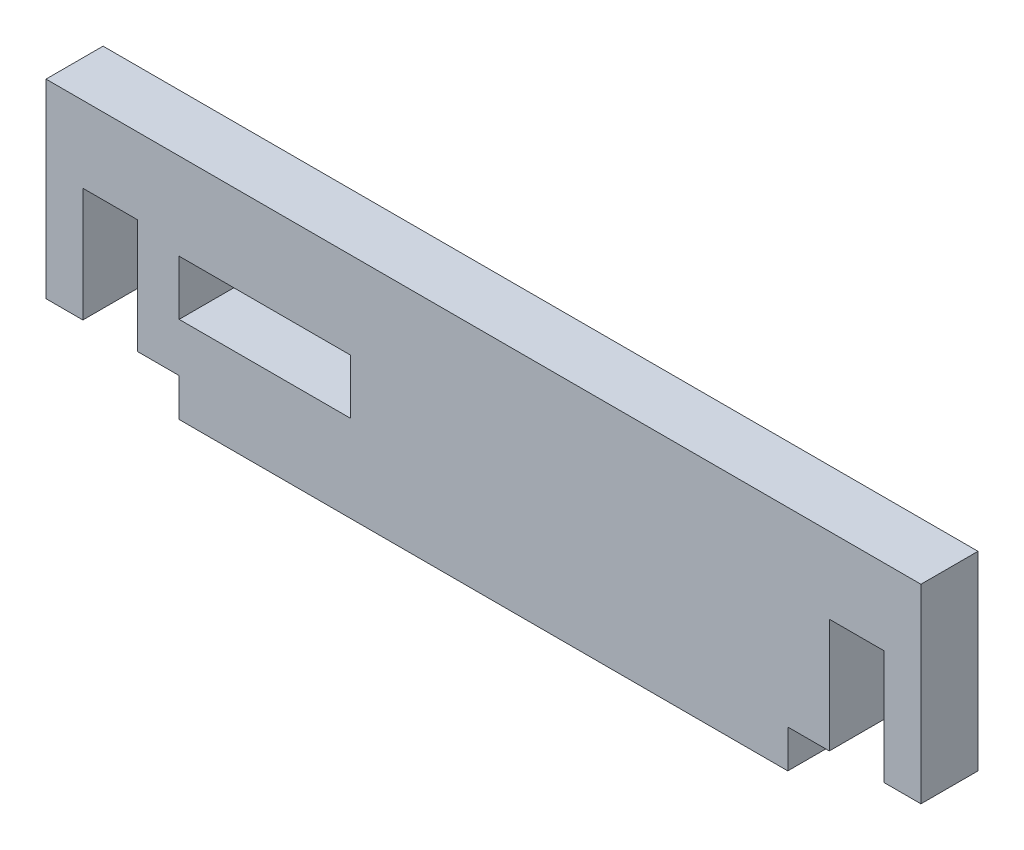
ISO-10303-21;
HEADER;
FILE_DESCRIPTION(('STEP AP214'),'2;1');
FILE_NAME('part.step','',(''),(''),'','','');
FILE_SCHEMA(('AUTOMOTIVE_DESIGN { 1 0 10303 214 1 1 1 1 }'));
ENDSEC;
DATA;
#1=APPLICATION_CONTEXT('core data for automotive mechanical design processes');
#2=APPLICATION_PROTOCOL_DEFINITION('international standard','automotive_design',2000,#1);
#3=PRODUCT_CONTEXT('',#1,'mechanical');
#4=PRODUCT('Part','Part','',(#3));
#5=PRODUCT_RELATED_PRODUCT_CATEGORY('part','',(#4));
#6=PRODUCT_DEFINITION_FORMATION('','',#4);
#7=PRODUCT_DEFINITION_CONTEXT('part definition',#1,'design');
#8=PRODUCT_DEFINITION('design','',#6,#7);
#9=PRODUCT_DEFINITION_SHAPE('','',#8);
#10=(LENGTH_UNIT() NAMED_UNIT(*) SI_UNIT(.MILLI.,.METRE.));
#11=(NAMED_UNIT(*) PLANE_ANGLE_UNIT() SI_UNIT($,.RADIAN.));
#12=(NAMED_UNIT(*) SI_UNIT($,.STERADIAN.) SOLID_ANGLE_UNIT());
#13=UNCERTAINTY_MEASURE_WITH_UNIT(LENGTH_MEASURE(1.E-05),#10,'distance_accuracy_value','');
#14=(GEOMETRIC_REPRESENTATION_CONTEXT(3) GLOBAL_UNCERTAINTY_ASSIGNED_CONTEXT((#13)) GLOBAL_UNIT_ASSIGNED_CONTEXT((#10,
#11,#12)) REPRESENTATION_CONTEXT('',''));
#15=CARTESIAN_POINT('',(0.,0.,0.));
#16=DIRECTION('',(0.,0.,1.));
#17=DIRECTION('',(1.,0.,0.));
#18=AXIS2_PLACEMENT_3D('',#15,#16,#17);
#19=CARTESIAN_POINT('',(0.,4.56,3.));
#20=DIRECTION('',(0.,1.,0.));
#21=DIRECTION('',(-1.,0.,0.));
#22=AXIS2_PLACEMENT_3D('',#19,#20,#21);
#23=PLANE('',#22);
#24=DIRECTION('',(1.,0.,0.));
#25=VECTOR('',#24,1.);
#26=CARTESIAN_POINT('',(0.,4.56,0.));
#27=LINE('',#26,#25);
#28=CARTESIAN_POINT('',(0.,4.56,0.));
#29=VERTEX_POINT('',#28);
#30=CARTESIAN_POINT('',(9.,4.56,0.));
#31=VERTEX_POINT('',#30);
#32=EDGE_CURVE('E260',#29,#31,#27,.T.);
#33=ORIENTED_EDGE('',*,*,#32,.F.);
#34=DIRECTION('',(0.,0.,-1.));
#35=VECTOR('',#34,1.);
#36=CARTESIAN_POINT('',(0.,4.56,3.));
#37=LINE('',#36,#35);
#38=CARTESIAN_POINT('',(0.,4.56,3.));
#39=VERTEX_POINT('',#38);
#40=EDGE_CURVE('E12',#39,#29,#37,.T.);
#41=ORIENTED_EDGE('',*,*,#40,.F.);
#42=DIRECTION('',(1.,0.,0.));
#43=VECTOR('',#42,1.);
#44=CARTESIAN_POINT('',(0.,4.56,3.));
#45=LINE('',#44,#43);
#46=CARTESIAN_POINT('',(9.,4.56,3.));
#47=VERTEX_POINT('',#46);
#48=EDGE_CURVE('E201',#39,#47,#45,.T.);
#49=ORIENTED_EDGE('',*,*,#48,.T.);
#50=DIRECTION('',(0.,0.,-1.));
#51=VECTOR('',#50,1.);
#52=CARTESIAN_POINT('',(9.,4.56,3.));
#53=LINE('',#52,#51);
#54=EDGE_CURVE('E130',#47,#31,#53,.T.);
#55=ORIENTED_EDGE('',*,*,#54,.T.);
#56=EDGE_LOOP('',(#33,#41,#49,#55));
#57=FACE_BOUND('',#56,.T.);
#58=ADVANCED_FACE('F41',(#57),#23,.T.);
#59=CARTESIAN_POINT('',(0.,0.,3.));
#60=DIRECTION('',(-1.,0.,0.));
#61=DIRECTION('',(0.,0.,1.));
#62=AXIS2_PLACEMENT_3D('',#59,#60,#61);
#63=PLANE('',#62);
#64=DIRECTION('',(0.,1.,0.));
#65=VECTOR('',#64,1.);
#66=CARTESIAN_POINT('',(0.,0.,0.));
#67=LINE('',#66,#65);
#68=CARTESIAN_POINT('',(0.,7.437,0.));
#69=VERTEX_POINT('',#68);
#70=EDGE_CURVE('E207',#29,#69,#67,.T.);
#71=ORIENTED_EDGE('',*,*,#70,.T.);
#72=DIRECTION('',(0.,0.,-1.));
#73=VECTOR('',#72,1.);
#74=CARTESIAN_POINT('',(0.,7.437,3.));
#75=LINE('',#74,#73);
#76=CARTESIAN_POINT('',(0.,7.437,3.));
#77=VERTEX_POINT('',#76);
#78=EDGE_CURVE('E51',#77,#69,#75,.T.);
#79=ORIENTED_EDGE('',*,*,#78,.F.);
#80=DIRECTION('',(0.,1.,0.));
#81=VECTOR('',#80,1.);
#82=CARTESIAN_POINT('',(0.,0.,3.));
#83=LINE('',#82,#81);
#84=EDGE_CURVE('E197',#39,#77,#83,.T.);
#85=ORIENTED_EDGE('',*,*,#84,.F.);
#86=ORIENTED_EDGE('',*,*,#40,.T.);
#87=EDGE_LOOP('',(#71,#79,#85,#86));
#88=FACE_BOUND('',#87,.T.);
#89=ADVANCED_FACE('F205',(#88),#63,.F.);
#90=CARTESIAN_POINT('',(0.,7.437,3.));
#91=DIRECTION('',(0.,1.,0.));
#92=DIRECTION('',(0.,0.,1.));
#93=AXIS2_PLACEMENT_3D('',#90,#91,#92);
#94=PLANE('',#93);
#95=DIRECTION('',(1.,0.,0.));
#96=VECTOR('',#95,1.);
#97=CARTESIAN_POINT('',(0.,7.437,0.));
#98=LINE('',#97,#96);
#99=CARTESIAN_POINT('',(9.,7.437,0.));
#100=VERTEX_POINT('',#99);
#101=EDGE_CURVE('E257',#69,#100,#98,.T.);
#102=ORIENTED_EDGE('',*,*,#101,.T.);
#103=DIRECTION('',(0.,0.,-1.));
#104=VECTOR('',#103,1.);
#105=CARTESIAN_POINT('',(9.,7.437,3.));
#106=LINE('',#105,#104);
#107=CARTESIAN_POINT('',(9.,7.437,3.));
#108=VERTEX_POINT('',#107);
#109=EDGE_CURVE('E195',#108,#100,#106,.T.);
#110=ORIENTED_EDGE('',*,*,#109,.F.);
#111=DIRECTION('',(1.,0.,0.));
#112=VECTOR('',#111,1.);
#113=CARTESIAN_POINT('',(0.,7.437,3.));
#114=LINE('',#113,#112);
#115=EDGE_CURVE('E189',#77,#108,#114,.T.);
#116=ORIENTED_EDGE('',*,*,#115,.F.);
#117=ORIENTED_EDGE('',*,*,#78,.T.);
#118=EDGE_LOOP('',(#102,#110,#116,#117));
#119=FACE_BOUND('',#118,.T.);
#120=ADVANCED_FACE('F192',(#119),#94,.F.);
#121=CARTESIAN_POINT('',(39.,0.,3.));
#122=DIRECTION('',(1.,0.,0.));
#123=DIRECTION('',(0.,0.,-1.));
#124=AXIS2_PLACEMENT_3D('',#121,#122,#123);
#125=PLANE('',#124);
#126=DIRECTION('',(0.,-1.,0.));
#127=VECTOR('',#126,1.);
#128=CARTESIAN_POINT('',(39.,0.,0.));
#129=LINE('',#128,#127);
#130=CARTESIAN_POINT('',(39.,12.,0.));
#131=VERTEX_POINT('',#130);
#132=CARTESIAN_POINT('',(39.,2.,0.));
#133=VERTEX_POINT('',#132);
#134=EDGE_CURVE('E295',#131,#133,#129,.T.);
#135=ORIENTED_EDGE('',*,*,#134,.F.);
#136=DIRECTION('',(0.,0.,-1.));
#137=VECTOR('',#136,1.);
#138=CARTESIAN_POINT('',(39.,12.,3.));
#139=LINE('',#138,#137);
#140=CARTESIAN_POINT('',(39.,12.,3.));
#141=VERTEX_POINT('',#140);
#142=EDGE_CURVE('E45',#141,#131,#139,.T.);
#143=ORIENTED_EDGE('',*,*,#142,.F.);
#144=DIRECTION('',(0.,-1.,0.));
#145=VECTOR('',#144,1.);
#146=CARTESIAN_POINT('',(39.,0.,3.));
#147=LINE('',#146,#145);
#148=CARTESIAN_POINT('',(39.,2.,3.));
#149=VERTEX_POINT('',#148);
#150=EDGE_CURVE('E256',#141,#149,#147,.T.);
#151=ORIENTED_EDGE('',*,*,#150,.T.);
#152=DIRECTION('',(0.,0.,-1.));
#153=VECTOR('',#152,1.);
#154=CARTESIAN_POINT('',(39.,2.,3.));
#155=LINE('',#154,#153);
#156=EDGE_CURVE('E212',#149,#133,#155,.T.);
#157=ORIENTED_EDGE('',*,*,#156,.T.);
#158=EDGE_LOOP('',(#135,#143,#151,#157));
#159=FACE_BOUND('',#158,.T.);
#160=ADVANCED_FACE('F43',(#159),#125,.T.);
#161=CARTESIAN_POINT('',(0.,12.,3.));
#162=DIRECTION('',(0.,-1.,0.));
#163=DIRECTION('',(0.,0.,-1.));
#164=AXIS2_PLACEMENT_3D('',#161,#162,#163);
#165=PLANE('',#164);
#166=DIRECTION('',(-1.,0.,0.));
#167=VECTOR('',#166,1.);
#168=CARTESIAN_POINT('',(0.,12.,0.));
#169=LINE('',#168,#167);
#170=CARTESIAN_POINT('',(-7.,12.,0.));
#171=VERTEX_POINT('',#170);
#172=EDGE_CURVE('E293',#131,#171,#169,.T.);
#173=ORIENTED_EDGE('',*,*,#172,.T.);
#174=DIRECTION('',(0.,0.,-1.));
#175=VECTOR('',#174,1.);
#176=CARTESIAN_POINT('',(-7.,12.,3.));
#177=LINE('',#176,#175);
#178=CARTESIAN_POINT('',(-7.,12.,3.));
#179=VERTEX_POINT('',#178);
#180=EDGE_CURVE('E245',#179,#171,#177,.T.);
#181=ORIENTED_EDGE('',*,*,#180,.F.);
#182=DIRECTION('',(-1.,0.,0.));
#183=VECTOR('',#182,1.);
#184=CARTESIAN_POINT('',(0.,12.,3.));
#185=LINE('',#184,#183);
#186=EDGE_CURVE('E374',#141,#179,#185,.T.);
#187=ORIENTED_EDGE('',*,*,#186,.F.);
#188=ORIENTED_EDGE('',*,*,#142,.T.);
#189=EDGE_LOOP('',(#173,#181,#187,#188));
#190=FACE_BOUND('',#189,.T.);
#191=ADVANCED_FACE('F386',(#190),#165,.F.);
#192=CARTESIAN_POINT('',(-7.,0.,3.));
#193=DIRECTION('',(1.,0.,0.));
#194=DIRECTION('',(0.,0.,-1.));
#195=AXIS2_PLACEMENT_3D('',#192,#193,#194);
#196=PLANE('',#195);
#197=DIRECTION('',(0.,-1.,0.));
#198=VECTOR('',#197,1.);
#199=CARTESIAN_POINT('',(-7.,0.,0.));
#200=LINE('',#199,#198);
#201=CARTESIAN_POINT('',(-7.,2.,0.));
#202=VERTEX_POINT('',#201);
#203=EDGE_CURVE('E291',#171,#202,#200,.T.);
#204=ORIENTED_EDGE('',*,*,#203,.T.);
#205=DIRECTION('',(0.,0.,-1.));
#206=VECTOR('',#205,1.);
#207=CARTESIAN_POINT('',(-7.,2.,3.));
#208=LINE('',#207,#206);
#209=CARTESIAN_POINT('',(-7.,2.,3.));
#210=VERTEX_POINT('',#209);
#211=EDGE_CURVE('E244',#210,#202,#208,.T.);
#212=ORIENTED_EDGE('',*,*,#211,.F.);
#213=DIRECTION('',(0.,-1.,0.));
#214=VECTOR('',#213,1.);
#215=CARTESIAN_POINT('',(-7.,0.,3.));
#216=LINE('',#215,#214);
#217=EDGE_CURVE('E369',#179,#210,#216,.T.);
#218=ORIENTED_EDGE('',*,*,#217,.F.);
#219=ORIENTED_EDGE('',*,*,#180,.T.);
#220=EDGE_LOOP('',(#204,#212,#218,#219));
#221=FACE_BOUND('',#220,.T.);
#222=ADVANCED_FACE('F387',(#221),#196,.F.);
#223=CARTESIAN_POINT('',(0.,2.,3.));
#224=DIRECTION('',(0.,-1.,0.));
#225=DIRECTION('',(0.,0.,-1.));
#226=AXIS2_PLACEMENT_3D('',#223,#224,#225);
#227=PLANE('',#226);
#228=DIRECTION('',(-1.,0.,0.));
#229=VECTOR('',#228,1.);
#230=CARTESIAN_POINT('',(0.,2.,0.));
#231=LINE('',#230,#229);
#232=CARTESIAN_POINT('',(-5.0615,2.,0.));
#233=VERTEX_POINT('',#232);
#234=EDGE_CURVE('E288',#233,#202,#231,.T.);
#235=ORIENTED_EDGE('',*,*,#234,.F.);
#236=DIRECTION('',(0.,0.,-1.));
#237=VECTOR('',#236,1.);
#238=CARTESIAN_POINT('',(-5.0615,2.,3.));
#239=LINE('',#238,#237);
#240=CARTESIAN_POINT('',(-5.0615,2.,3.));
#241=VERTEX_POINT('',#240);
#242=EDGE_CURVE('E242',#241,#233,#239,.T.);
#243=ORIENTED_EDGE('',*,*,#242,.F.);
#244=DIRECTION('',(-1.,0.,0.));
#245=VECTOR('',#244,1.);
#246=CARTESIAN_POINT('',(0.,2.,3.));
#247=LINE('',#246,#245);
#248=EDGE_CURVE('E364',#241,#210,#247,.T.);
#249=ORIENTED_EDGE('',*,*,#248,.T.);
#250=ORIENTED_EDGE('',*,*,#211,.T.);
#251=EDGE_LOOP('',(#235,#243,#249,#250));
#252=FACE_BOUND('',#251,.T.);
#253=ADVANCED_FACE('F390',(#252),#227,.T.);
#254=CARTESIAN_POINT('',(-5.0615,0.,3.));
#255=DIRECTION('',(1.,0.,0.));
#256=DIRECTION('',(0.,0.,-1.));
#257=AXIS2_PLACEMENT_3D('',#254,#255,#256);
#258=PLANE('',#257);
#259=DIRECTION('',(0.,-1.,0.));
#260=VECTOR('',#259,1.);
#261=CARTESIAN_POINT('',(-5.0615,0.,0.));
#262=LINE('',#261,#260);
#263=CARTESIAN_POINT('',(-5.0615,8.,0.));
#264=VERTEX_POINT('',#263);
#265=EDGE_CURVE('E285',#264,#233,#262,.T.);
#266=ORIENTED_EDGE('',*,*,#265,.F.);
#267=DIRECTION('',(0.,0.,-1.));
#268=VECTOR('',#267,1.);
#269=CARTESIAN_POINT('',(-5.0615,8.,3.));
#270=LINE('',#269,#268);
#271=CARTESIAN_POINT('',(-5.0615,8.,3.));
#272=VERTEX_POINT('',#271);
#273=EDGE_CURVE('E240',#272,#264,#270,.T.);
#274=ORIENTED_EDGE('',*,*,#273,.F.);
#275=DIRECTION('',(0.,-1.,0.));
#276=VECTOR('',#275,1.);
#277=CARTESIAN_POINT('',(-5.0615,0.,3.));
#278=LINE('',#277,#276);
#279=EDGE_CURVE('E360',#272,#241,#278,.T.);
#280=ORIENTED_EDGE('',*,*,#279,.T.);
#281=ORIENTED_EDGE('',*,*,#242,.T.);
#282=EDGE_LOOP('',(#266,#274,#280,#281));
#283=FACE_BOUND('',#282,.T.);
#284=ADVANCED_FACE('F396',(#283),#258,.T.);
#285=CARTESIAN_POINT('',(0.,7.99999999999995,3.));
#286=DIRECTION('',(0.,-1.,0.));
#287=DIRECTION('',(1.,0.,0.));
#288=AXIS2_PLACEMENT_3D('',#285,#286,#287);
#289=PLANE('',#288);
#290=DIRECTION('',(-1.,0.,0.));
#291=VECTOR('',#290,1.);
#292=CARTESIAN_POINT('',(0.,7.99999999999995,0.));
#293=LINE('',#292,#291);
#294=CARTESIAN_POINT('',(-2.1845,7.99999999999997,0.));
#295=VERTEX_POINT('',#294);
#296=EDGE_CURVE('E282',#295,#264,#293,.T.);
#297=ORIENTED_EDGE('',*,*,#296,.F.);
#298=DIRECTION('',(0.,0.,-1.));
#299=VECTOR('',#298,1.);
#300=CARTESIAN_POINT('',(-2.1845,7.99999999999997,3.));
#301=LINE('',#300,#299);
#302=CARTESIAN_POINT('',(-2.1845,7.99999999999997,3.));
#303=VERTEX_POINT('',#302);
#304=EDGE_CURVE('E238',#303,#295,#301,.T.);
#305=ORIENTED_EDGE('',*,*,#304,.F.);
#306=DIRECTION('',(-1.,0.,0.));
#307=VECTOR('',#306,1.);
#308=CARTESIAN_POINT('',(0.,7.99999999999995,3.));
#309=LINE('',#308,#307);
#310=EDGE_CURVE('E353',#303,#272,#309,.T.);
#311=ORIENTED_EDGE('',*,*,#310,.T.);
#312=ORIENTED_EDGE('',*,*,#273,.T.);
#313=EDGE_LOOP('',(#297,#305,#311,#312));
#314=FACE_BOUND('',#313,.T.);
#315=ADVANCED_FACE('F399',(#314),#289,.T.);
#316=CARTESIAN_POINT('',(-2.1845,0.,3.));
#317=DIRECTION('',(-1.,0.,0.));
#318=DIRECTION('',(0.,0.,1.));
#319=AXIS2_PLACEMENT_3D('',#316,#317,#318);
#320=PLANE('',#319);
#321=DIRECTION('',(0.,1.,0.));
#322=VECTOR('',#321,1.);
#323=CARTESIAN_POINT('',(-2.1845,0.,0.));
#324=LINE('',#323,#322);
#325=CARTESIAN_POINT('',(-2.1845,2.,0.));
#326=VERTEX_POINT('',#325);
#327=EDGE_CURVE('E279',#326,#295,#324,.T.);
#328=ORIENTED_EDGE('',*,*,#327,.F.);
#329=DIRECTION('',(0.,0.,-1.));
#330=VECTOR('',#329,1.);
#331=CARTESIAN_POINT('',(-2.1845,2.,3.));
#332=LINE('',#331,#330);
#333=CARTESIAN_POINT('',(-2.1845,2.,3.));
#334=VERTEX_POINT('',#333);
#335=EDGE_CURVE('E236',#334,#326,#332,.T.);
#336=ORIENTED_EDGE('',*,*,#335,.F.);
#337=DIRECTION('',(0.,1.,0.));
#338=VECTOR('',#337,1.);
#339=CARTESIAN_POINT('',(-2.1845,0.,3.));
#340=LINE('',#339,#338);
#341=EDGE_CURVE('E348',#334,#303,#340,.T.);
#342=ORIENTED_EDGE('',*,*,#341,.T.);
#343=ORIENTED_EDGE('',*,*,#304,.T.);
#344=EDGE_LOOP('',(#328,#336,#342,#343));
#345=FACE_BOUND('',#344,.T.);
#346=ADVANCED_FACE('F422',(#345),#320,.T.);
#347=CARTESIAN_POINT('',(0.,2.,0.));
#348=VERTEX_POINT('',#347);
#349=EDGE_CURVE('E278',#348,#326,#231,.T.);
#350=ORIENTED_EDGE('',*,*,#349,.F.);
#351=DIRECTION('',(0.,0.,-1.));
#352=VECTOR('',#351,1.);
#353=CARTESIAN_POINT('',(0.,2.,3.));
#354=LINE('',#353,#352);
#355=CARTESIAN_POINT('',(0.,2.,3.));
#356=VERTEX_POINT('',#355);
#357=EDGE_CURVE('E234',#356,#348,#354,.T.);
#358=ORIENTED_EDGE('',*,*,#357,.F.);
#359=EDGE_CURVE('E347',#356,#334,#247,.T.);
#360=ORIENTED_EDGE('',*,*,#359,.T.);
#361=ORIENTED_EDGE('',*,*,#335,.T.);
#362=EDGE_LOOP('',(#350,#358,#360,#361));
#363=FACE_BOUND('',#362,.T.);
#364=ADVANCED_FACE('F426',(#363),#227,.T.);
#365=CARTESIAN_POINT('',(0.,0.,3.));
#366=DIRECTION('',(-1.,0.,0.));
#367=DIRECTION('',(0.,0.,1.));
#368=AXIS2_PLACEMENT_3D('',#365,#366,#367);
#369=PLANE('',#368);
#370=DIRECTION('',(0.,1.,0.));
#371=VECTOR('',#370,1.);
#372=CARTESIAN_POINT('',(0.,0.,0.));
#373=LINE('',#372,#371);
#374=CARTESIAN_POINT('',(0.,0.,0.));
#375=VERTEX_POINT('',#374);
#376=EDGE_CURVE('E275',#375,#348,#373,.T.);
#377=ORIENTED_EDGE('',*,*,#376,.F.);
#378=DIRECTION('',(0.,0.,-1.));
#379=VECTOR('',#378,1.);
#380=CARTESIAN_POINT('',(0.,0.,3.));
#381=LINE('',#380,#379);
#382=CARTESIAN_POINT('',(0.,0.,3.));
#383=VERTEX_POINT('',#382);
#384=EDGE_CURVE('E232',#383,#375,#381,.T.);
#385=ORIENTED_EDGE('',*,*,#384,.F.);
#386=DIRECTION('',(0.,1.,0.));
#387=VECTOR('',#386,1.);
#388=CARTESIAN_POINT('',(0.,0.,3.));
#389=LINE('',#388,#387);
#390=EDGE_CURVE('E342',#383,#356,#389,.T.);
#391=ORIENTED_EDGE('',*,*,#390,.T.);
#392=ORIENTED_EDGE('',*,*,#357,.T.);
#393=EDGE_LOOP('',(#377,#385,#391,#392));
#394=FACE_BOUND('',#393,.T.);
#395=ADVANCED_FACE('F429',(#394),#369,.T.);
#396=CARTESIAN_POINT('',(0.,0.,3.));
#397=DIRECTION('',(0.,1.,0.));
#398=DIRECTION('',(0.,0.,1.));
#399=AXIS2_PLACEMENT_3D('',#396,#397,#398);
#400=PLANE('',#399);
#401=DIRECTION('',(1.,0.,0.));
#402=VECTOR('',#401,1.);
#403=CARTESIAN_POINT('',(0.,0.,0.));
#404=LINE('',#403,#402);
#405=CARTESIAN_POINT('',(32.,0.,0.));
#406=VERTEX_POINT('',#405);
#407=EDGE_CURVE('E273',#375,#406,#404,.T.);
#408=ORIENTED_EDGE('',*,*,#407,.T.);
#409=DIRECTION('',(0.,0.,-1.));
#410=VECTOR('',#409,1.);
#411=CARTESIAN_POINT('',(32.,0.,3.));
#412=LINE('',#411,#410);
#413=CARTESIAN_POINT('',(32.,0.,3.));
#414=VERTEX_POINT('',#413);
#415=EDGE_CURVE('E229',#414,#406,#412,.T.);
#416=ORIENTED_EDGE('',*,*,#415,.F.);
#417=DIRECTION('',(1.,0.,0.));
#418=VECTOR('',#417,1.);
#419=CARTESIAN_POINT('',(0.,0.,3.));
#420=LINE('',#419,#418);
#421=EDGE_CURVE('E334',#383,#414,#420,.T.);
#422=ORIENTED_EDGE('',*,*,#421,.F.);
#423=ORIENTED_EDGE('',*,*,#384,.T.);
#424=EDGE_LOOP('',(#408,#416,#422,#423));
#425=FACE_BOUND('',#424,.T.);
#426=ADVANCED_FACE('F435',(#425),#400,.F.);
#427=CARTESIAN_POINT('',(32.,0.,3.));
#428=DIRECTION('',(-1.,0.,0.));
#429=DIRECTION('',(0.,0.,1.));
#430=AXIS2_PLACEMENT_3D('',#427,#428,#429);
#431=PLANE('',#430);
#432=DIRECTION('',(0.,1.,0.));
#433=VECTOR('',#432,1.);
#434=CARTESIAN_POINT('',(32.,0.,0.));
#435=LINE('',#434,#433);
#436=CARTESIAN_POINT('',(32.,2.,0.));
#437=VERTEX_POINT('',#436);
#438=EDGE_CURVE('E271',#406,#437,#435,.T.);
#439=ORIENTED_EDGE('',*,*,#438,.T.);
#440=DIRECTION('',(0.,0.,-1.));
#441=VECTOR('',#440,1.);
#442=CARTESIAN_POINT('',(32.,2.,3.));
#443=LINE('',#442,#441);
#444=CARTESIAN_POINT('',(32.,2.,3.));
#445=VERTEX_POINT('',#444);
#446=EDGE_CURVE('E226',#445,#437,#443,.T.);
#447=ORIENTED_EDGE('',*,*,#446,.F.);
#448=DIRECTION('',(0.,1.,0.));
#449=VECTOR('',#448,1.);
#450=CARTESIAN_POINT('',(32.,0.,3.));
#451=LINE('',#450,#449);
#452=EDGE_CURVE('E329',#414,#445,#451,.T.);
#453=ORIENTED_EDGE('',*,*,#452,.F.);
#454=ORIENTED_EDGE('',*,*,#415,.T.);
#455=EDGE_LOOP('',(#439,#447,#453,#454));
#456=FACE_BOUND('',#455,.T.);
#457=ADVANCED_FACE('F439',(#456),#431,.F.);
#458=CARTESIAN_POINT('',(0.,2.,3.));
#459=DIRECTION('',(0.,1.,0.));
#460=DIRECTION('',(0.,0.,1.));
#461=AXIS2_PLACEMENT_3D('',#458,#459,#460);
#462=PLANE('',#461);
#463=DIRECTION('',(1.,0.,0.));
#464=VECTOR('',#463,1.);
#465=CARTESIAN_POINT('',(0.,2.,0.));
#466=LINE('',#465,#464);
#467=CARTESIAN_POINT('',(34.1845,2.,0.));
#468=VERTEX_POINT('',#467);
#469=EDGE_CURVE('E269',#437,#468,#466,.T.);
#470=ORIENTED_EDGE('',*,*,#469,.T.);
#471=DIRECTION('',(0.,0.,-1.));
#472=VECTOR('',#471,1.);
#473=CARTESIAN_POINT('',(34.1845,2.,3.));
#474=LINE('',#473,#472);
#475=CARTESIAN_POINT('',(34.1845,2.,3.));
#476=VERTEX_POINT('',#475);
#477=EDGE_CURVE('E223',#476,#468,#474,.T.);
#478=ORIENTED_EDGE('',*,*,#477,.F.);
#479=DIRECTION('',(1.,0.,0.));
#480=VECTOR('',#479,1.);
#481=CARTESIAN_POINT('',(0.,2.,3.));
#482=LINE('',#481,#480);
#483=EDGE_CURVE('E325',#445,#476,#482,.T.);
#484=ORIENTED_EDGE('',*,*,#483,.F.);
#485=ORIENTED_EDGE('',*,*,#446,.T.);
#486=EDGE_LOOP('',(#470,#478,#484,#485));
#487=FACE_BOUND('',#486,.T.);
#488=ADVANCED_FACE('F444',(#487),#462,.F.);
#489=CARTESIAN_POINT('',(34.1845,0.,3.));
#490=DIRECTION('',(-1.,0.,0.));
#491=DIRECTION('',(0.,0.,1.));
#492=AXIS2_PLACEMENT_3D('',#489,#490,#491);
#493=PLANE('',#492);
#494=DIRECTION('',(0.,1.,0.));
#495=VECTOR('',#494,1.);
#496=CARTESIAN_POINT('',(34.1845,0.,0.));
#497=LINE('',#496,#495);
#498=CARTESIAN_POINT('',(34.1845,7.99999999999997,0.));
#499=VERTEX_POINT('',#498);
#500=EDGE_CURVE('E267',#468,#499,#497,.T.);
#501=ORIENTED_EDGE('',*,*,#500,.T.);
#502=DIRECTION('',(0.,0.,-1.));
#503=VECTOR('',#502,1.);
#504=CARTESIAN_POINT('',(34.1845,7.99999999999997,3.));
#505=LINE('',#504,#503);
#506=CARTESIAN_POINT('',(34.1845,7.99999999999997,3.));
#507=VERTEX_POINT('',#506);
#508=EDGE_CURVE('E220',#507,#499,#505,.T.);
#509=ORIENTED_EDGE('',*,*,#508,.F.);
#510=DIRECTION('',(0.,1.,0.));
#511=VECTOR('',#510,1.);
#512=CARTESIAN_POINT('',(34.1845,0.,3.));
#513=LINE('',#512,#511);
#514=EDGE_CURVE('E322',#476,#507,#513,.T.);
#515=ORIENTED_EDGE('',*,*,#514,.F.);
#516=ORIENTED_EDGE('',*,*,#477,.T.);
#517=EDGE_LOOP('',(#501,#509,#515,#516));
#518=FACE_BOUND('',#517,.T.);
#519=ADVANCED_FACE('F450',(#518),#493,.F.);
#520=CARTESIAN_POINT('',(0.,7.99999999999962,3.));
#521=DIRECTION('',(0.,1.,0.));
#522=DIRECTION('',(-1.,0.,0.));
#523=AXIS2_PLACEMENT_3D('',#520,#521,#522);
#524=PLANE('',#523);
#525=DIRECTION('',(1.,0.,0.));
#526=VECTOR('',#525,1.);
#527=CARTESIAN_POINT('',(0.,7.99999999999962,0.));
#528=LINE('',#527,#526);
#529=CARTESIAN_POINT('',(37.0615,8.,0.));
#530=VERTEX_POINT('',#529);
#531=EDGE_CURVE('E265',#499,#530,#528,.T.);
#532=ORIENTED_EDGE('',*,*,#531,.T.);
#533=DIRECTION('',(0.,0.,-1.));
#534=VECTOR('',#533,1.);
#535=CARTESIAN_POINT('',(37.0615,8.,3.));
#536=LINE('',#535,#534);
#537=CARTESIAN_POINT('',(37.0615,8.,3.));
#538=VERTEX_POINT('',#537);
#539=EDGE_CURVE('E217',#538,#530,#536,.T.);
#540=ORIENTED_EDGE('',*,*,#539,.F.);
#541=DIRECTION('',(1.,0.,0.));
#542=VECTOR('',#541,1.);
#543=CARTESIAN_POINT('',(0.,7.99999999999962,3.));
#544=LINE('',#543,#542);
#545=EDGE_CURVE('E315',#507,#538,#544,.T.);
#546=ORIENTED_EDGE('',*,*,#545,.F.);
#547=ORIENTED_EDGE('',*,*,#508,.T.);
#548=EDGE_LOOP('',(#532,#540,#546,#547));
#549=FACE_BOUND('',#548,.T.);
#550=ADVANCED_FACE('F454',(#549),#524,.F.);
#551=CARTESIAN_POINT('',(37.0615,0.,3.));
#552=DIRECTION('',(1.,0.,0.));
#553=DIRECTION('',(0.,0.,-1.));
#554=AXIS2_PLACEMENT_3D('',#551,#552,#553);
#555=PLANE('',#554);
#556=DIRECTION('',(0.,-1.,0.));
#557=VECTOR('',#556,1.);
#558=CARTESIAN_POINT('',(37.0615,0.,0.));
#559=LINE('',#558,#557);
#560=CARTESIAN_POINT('',(37.0615,2.,0.));
#561=VERTEX_POINT('',#560);
#562=EDGE_CURVE('E263',#530,#561,#559,.T.);
#563=ORIENTED_EDGE('',*,*,#562,.T.);
#564=DIRECTION('',(0.,0.,-1.));
#565=VECTOR('',#564,1.);
#566=CARTESIAN_POINT('',(37.0615,2.,3.));
#567=LINE('',#566,#565);
#568=CARTESIAN_POINT('',(37.0615,2.,3.));
#569=VERTEX_POINT('',#568);
#570=EDGE_CURVE('E214',#569,#561,#567,.T.);
#571=ORIENTED_EDGE('',*,*,#570,.F.);
#572=DIRECTION('',(0.,-1.,0.));
#573=VECTOR('',#572,1.);
#574=CARTESIAN_POINT('',(37.0615,0.,3.));
#575=LINE('',#574,#573);
#576=EDGE_CURVE('E311',#538,#569,#575,.T.);
#577=ORIENTED_EDGE('',*,*,#576,.F.);
#578=ORIENTED_EDGE('',*,*,#539,.T.);
#579=EDGE_LOOP('',(#563,#571,#577,#578));
#580=FACE_BOUND('',#579,.T.);
#581=ADVANCED_FACE('F456',(#580),#555,.F.);
#582=EDGE_CURVE('E262',#561,#133,#466,.T.);
#583=ORIENTED_EDGE('',*,*,#582,.T.);
#584=ORIENTED_EDGE('',*,*,#156,.F.);
#585=EDGE_CURVE('E310',#569,#149,#482,.T.);
#586=ORIENTED_EDGE('',*,*,#585,.F.);
#587=ORIENTED_EDGE('',*,*,#570,.T.);
#588=EDGE_LOOP('',(#583,#584,#586,#587));
#589=FACE_BOUND('',#588,.T.);
#590=ADVANCED_FACE('F413',(#589),#462,.F.);
#591=CARTESIAN_POINT('',(9.,0.,3.));
#592=DIRECTION('',(1.,0.,0.));
#593=DIRECTION('',(0.,0.,-1.));
#594=AXIS2_PLACEMENT_3D('',#591,#592,#593);
#595=PLANE('',#594);
#596=DIRECTION('',(0.,-1.,0.));
#597=VECTOR('',#596,1.);
#598=CARTESIAN_POINT('',(9.,0.,0.));
#599=LINE('',#598,#597);
#600=EDGE_CURVE('E123',#100,#31,#599,.T.);
#601=ORIENTED_EDGE('',*,*,#600,.T.);
#602=ORIENTED_EDGE('',*,*,#54,.F.);
#603=DIRECTION('',(0.,-1.,0.));
#604=VECTOR('',#603,1.);
#605=CARTESIAN_POINT('',(9.,0.,3.));
#606=LINE('',#605,#604);
#607=EDGE_CURVE('E60',#108,#47,#606,.T.);
#608=ORIENTED_EDGE('',*,*,#607,.F.);
#609=ORIENTED_EDGE('',*,*,#109,.T.);
#610=EDGE_LOOP('',(#601,#602,#608,#609));
#611=FACE_BOUND('',#610,.T.);
#612=ADVANCED_FACE('F463',(#611),#595,.F.);
#613=CARTESIAN_POINT('',(0.,0.,3.));
#614=DIRECTION('',(0.,0.,1.));
#615=DIRECTION('',(1.,0.,0.));
#616=AXIS2_PLACEMENT_3D('',#613,#614,#615);
#617=PLANE('',#616);
#618=ORIENTED_EDGE('',*,*,#150,.F.);
#619=ORIENTED_EDGE('',*,*,#186,.T.);
#620=ORIENTED_EDGE('',*,*,#217,.T.);
#621=ORIENTED_EDGE('',*,*,#248,.F.);
#622=ORIENTED_EDGE('',*,*,#279,.F.);
#623=ORIENTED_EDGE('',*,*,#310,.F.);
#624=ORIENTED_EDGE('',*,*,#341,.F.);
#625=ORIENTED_EDGE('',*,*,#359,.F.);
#626=ORIENTED_EDGE('',*,*,#390,.F.);
#627=ORIENTED_EDGE('',*,*,#421,.T.);
#628=ORIENTED_EDGE('',*,*,#452,.T.);
#629=ORIENTED_EDGE('',*,*,#483,.T.);
#630=ORIENTED_EDGE('',*,*,#514,.T.);
#631=ORIENTED_EDGE('',*,*,#545,.T.);
#632=ORIENTED_EDGE('',*,*,#576,.T.);
#633=ORIENTED_EDGE('',*,*,#585,.T.);
#634=EDGE_LOOP('',(#618,#619,#620,#621,#622,#623,#624,#625,#626,#627,#628,#629,#630,#631,#632,#633));
#635=FACE_BOUND('',#634,.T.);
#636=ORIENTED_EDGE('',*,*,#48,.F.);
#637=ORIENTED_EDGE('',*,*,#84,.T.);
#638=ORIENTED_EDGE('',*,*,#115,.T.);
#639=ORIENTED_EDGE('',*,*,#607,.T.);
#640=EDGE_LOOP('',(#636,#637,#638,#639));
#641=FACE_BOUND('',#640,.T.);
#642=ADVANCED_FACE('F200',(#635,#641),#617,.T.);
#643=CARTESIAN_POINT('',(0.,0.,0.));
#644=DIRECTION('',(0.,0.,1.));
#645=DIRECTION('',(1.,0.,0.));
#646=AXIS2_PLACEMENT_3D('',#643,#644,#645);
#647=PLANE('',#646);
#648=ORIENTED_EDGE('',*,*,#134,.T.);
#649=ORIENTED_EDGE('',*,*,#582,.F.);
#650=ORIENTED_EDGE('',*,*,#562,.F.);
#651=ORIENTED_EDGE('',*,*,#531,.F.);
#652=ORIENTED_EDGE('',*,*,#500,.F.);
#653=ORIENTED_EDGE('',*,*,#469,.F.);
#654=ORIENTED_EDGE('',*,*,#438,.F.);
#655=ORIENTED_EDGE('',*,*,#407,.F.);
#656=ORIENTED_EDGE('',*,*,#376,.T.);
#657=ORIENTED_EDGE('',*,*,#349,.T.);
#658=ORIENTED_EDGE('',*,*,#327,.T.);
#659=ORIENTED_EDGE('',*,*,#296,.T.);
#660=ORIENTED_EDGE('',*,*,#265,.T.);
#661=ORIENTED_EDGE('',*,*,#234,.T.);
#662=ORIENTED_EDGE('',*,*,#203,.F.);
#663=ORIENTED_EDGE('',*,*,#172,.F.);
#664=EDGE_LOOP('',(#648,#649,#650,#651,#652,#653,#654,#655,#656,#657,#658,#659,#660,#661,#662,#663));
#665=FACE_BOUND('',#664,.T.);
#666=ORIENTED_EDGE('',*,*,#32,.T.);
#667=ORIENTED_EDGE('',*,*,#600,.F.);
#668=ORIENTED_EDGE('',*,*,#101,.F.);
#669=ORIENTED_EDGE('',*,*,#70,.F.);
#670=EDGE_LOOP('',(#666,#667,#668,#669));
#671=FACE_BOUND('',#670,.T.);
#672=ADVANCED_FACE('F416',(#665,#671),#647,.F.);
#673=CLOSED_SHELL('',(#58,#89,#120,#160,#191,#222,#253,#284,#315,#346,#364,#395,#426,#457,#488,
#519,#550,#581,#590,#612,#642,#672));
#674=MANIFOLD_SOLID_BREP('B2',#673);
#675=ADVANCED_BREP_SHAPE_REPRESENTATION('',(#18,#674),#14);
#676=SHAPE_DEFINITION_REPRESENTATION(#9,#675);
ENDSEC;
END-ISO-10303-21;
